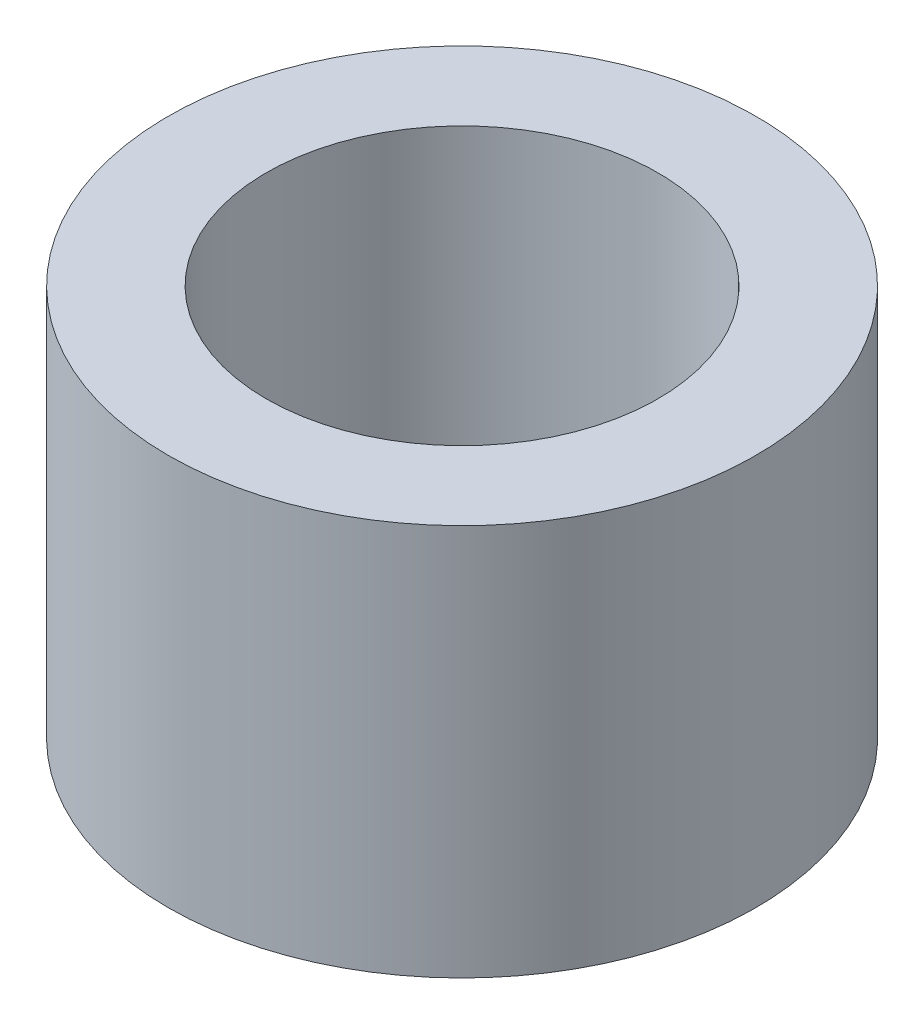
ISO-10303-21;
HEADER;
FILE_DESCRIPTION(('STEP AP214'),'2;1');
FILE_NAME('part.step','',(''),(''),'','','');
FILE_SCHEMA(('AUTOMOTIVE_DESIGN { 1 0 10303 214 1 1 1 1 }'));
ENDSEC;
DATA;
#1=APPLICATION_CONTEXT('core data for automotive mechanical design processes');
#2=APPLICATION_PROTOCOL_DEFINITION('international standard','automotive_design',2000,#1);
#3=PRODUCT_CONTEXT('',#1,'mechanical');
#4=PRODUCT('Part','Part','',(#3));
#5=PRODUCT_RELATED_PRODUCT_CATEGORY('part','',(#4));
#6=PRODUCT_DEFINITION_FORMATION('','',#4);
#7=PRODUCT_DEFINITION_CONTEXT('part definition',#1,'design');
#8=PRODUCT_DEFINITION('design','',#6,#7);
#9=PRODUCT_DEFINITION_SHAPE('','',#8);
#10=(LENGTH_UNIT() NAMED_UNIT(*) SI_UNIT(.MILLI.,.METRE.));
#11=(NAMED_UNIT(*) PLANE_ANGLE_UNIT() SI_UNIT($,.RADIAN.));
#12=(NAMED_UNIT(*) SI_UNIT($,.STERADIAN.) SOLID_ANGLE_UNIT());
#13=UNCERTAINTY_MEASURE_WITH_UNIT(LENGTH_MEASURE(1.E-05),#10,'distance_accuracy_value','');
#14=(GEOMETRIC_REPRESENTATION_CONTEXT(3) GLOBAL_UNCERTAINTY_ASSIGNED_CONTEXT((#13)) GLOBAL_UNIT_ASSIGNED_CONTEXT((#10,
#11,#12)) REPRESENTATION_CONTEXT('',''));
#15=CARTESIAN_POINT('',(0.,0.,0.));
#16=DIRECTION('',(0.,0.,1.));
#17=DIRECTION('',(1.,0.,0.));
#18=AXIS2_PLACEMENT_3D('',#15,#16,#17);
#19=CARTESIAN_POINT('',(-10.6089931925858,12.7,4.89126237102765));
#20=DIRECTION('',(0.,1.,0.));
#21=DIRECTION('',(0.,0.,1.));
#22=AXIS2_PLACEMENT_3D('',#19,#20,#21);
#23=PLANE('',#22);
#24=CARTESIAN_POINT('',(-10.6089931925858,12.7,4.89126237102765));
#25=DIRECTION('',(0.,1.,0.));
#26=DIRECTION('',(0.,0.,1.));
#27=AXIS2_PLACEMENT_3D('',#24,#25,#26);
#28=CIRCLE('',#27,9.525);
#29=CARTESIAN_POINT('',(-10.6089931925858,12.7,14.4162623710276));
#30=VERTEX_POINT('',#29);
#31=EDGE_CURVE('E10',#30,#30,#28,.T.);
#32=ORIENTED_EDGE('',*,*,#31,.T.);
#33=EDGE_LOOP('',(#32));
#34=FACE_BOUND('',#33,.T.);
#35=CARTESIAN_POINT('',(-10.6089931925858,12.7,4.89126237102765));
#36=DIRECTION('',(0.,1.,0.));
#37=DIRECTION('',(0.,0.,1.));
#38=AXIS2_PLACEMENT_3D('',#35,#36,#37);
#39=CIRCLE('',#38,6.35);
#40=CARTESIAN_POINT('',(-10.6089931925858,12.7,11.2412623710276));
#41=VERTEX_POINT('',#40);
#42=EDGE_CURVE('E43',#41,#41,#39,.T.);
#43=ORIENTED_EDGE('',*,*,#42,.F.);
#44=EDGE_LOOP('',(#43));
#45=FACE_BOUND('',#44,.T.);
#46=ADVANCED_FACE('F32',(#34,#45),#23,.T.);
#47=CARTESIAN_POINT('',(-10.6089931925858,0.,4.89126237102765));
#48=DIRECTION('',(0.,1.,0.));
#49=DIRECTION('',(0.,0.,1.));
#50=AXIS2_PLACEMENT_3D('',#47,#48,#49);
#51=PLANE('',#50);
#52=CARTESIAN_POINT('',(-10.6089931925858,0.,4.89126237102765));
#53=DIRECTION('',(0.,1.,0.));
#54=DIRECTION('',(0.,0.,1.));
#55=AXIS2_PLACEMENT_3D('',#52,#53,#54);
#56=CIRCLE('',#55,9.525);
#57=CARTESIAN_POINT('',(-10.6089931925858,0.,14.4162623710276));
#58=VERTEX_POINT('',#57);
#59=EDGE_CURVE('E36',#58,#58,#56,.T.);
#60=ORIENTED_EDGE('',*,*,#59,.F.);
#61=EDGE_LOOP('',(#60));
#62=FACE_BOUND('',#61,.T.);
#63=CARTESIAN_POINT('',(-10.6089931925858,0.,4.89126237102765));
#64=DIRECTION('',(0.,1.,0.));
#65=DIRECTION('',(0.,0.,1.));
#66=AXIS2_PLACEMENT_3D('',#63,#64,#65);
#67=CIRCLE('',#66,6.35);
#68=CARTESIAN_POINT('',(-10.6089931925858,0.,11.2412623710276));
#69=VERTEX_POINT('',#68);
#70=EDGE_CURVE('E45',#69,#69,#67,.T.);
#71=ORIENTED_EDGE('',*,*,#70,.T.);
#72=EDGE_LOOP('',(#71));
#73=FACE_BOUND('',#72,.T.);
#74=ADVANCED_FACE('F55',(#62,#73),#51,.F.);
#75=CARTESIAN_POINT('',(-10.6089931925858,12.7,4.89126237102765));
#76=DIRECTION('',(0.,-1.,0.));
#77=DIRECTION('',(0.,0.,-1.));
#78=AXIS2_PLACEMENT_3D('',#75,#76,#77);
#79=CYLINDRICAL_SURFACE('',#78,9.525);
#80=ORIENTED_EDGE('',*,*,#31,.F.);
#81=EDGE_LOOP('',(#80));
#82=FACE_BOUND('',#81,.T.);
#83=ORIENTED_EDGE('',*,*,#59,.T.);
#84=EDGE_LOOP('',(#83));
#85=FACE_BOUND('',#84,.T.);
#86=ADVANCED_FACE('F34',(#82,#85),#79,.T.);
#87=CARTESIAN_POINT('',(-10.6089931925858,12.7,4.89126237102765));
#88=DIRECTION('',(0.,-1.,0.));
#89=DIRECTION('',(0.,0.,-1.));
#90=AXIS2_PLACEMENT_3D('',#87,#88,#89);
#91=CYLINDRICAL_SURFACE('',#90,6.35);
#92=ORIENTED_EDGE('',*,*,#42,.T.);
#93=EDGE_LOOP('',(#92));
#94=FACE_BOUND('',#93,.T.);
#95=ORIENTED_EDGE('',*,*,#70,.F.);
#96=EDGE_LOOP('',(#95));
#97=FACE_BOUND('',#96,.T.);
#98=ADVANCED_FACE('F51',(#94,#97),#91,.F.);
#99=CLOSED_SHELL('',(#46,#74,#86,#98));
#100=MANIFOLD_SOLID_BREP('B2',#99);
#101=ADVANCED_BREP_SHAPE_REPRESENTATION('',(#18,#100),#14);
#102=SHAPE_DEFINITION_REPRESENTATION(#9,#101);
ENDSEC;
END-ISO-10303-21;
